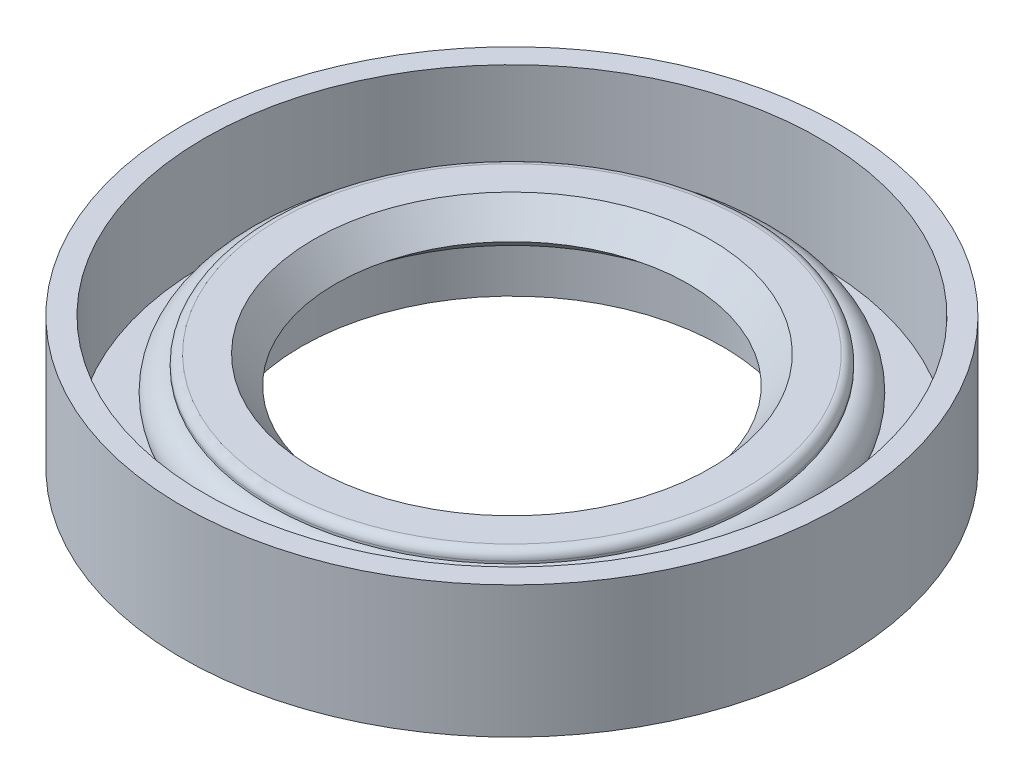
ISO-10303-21;
HEADER;
FILE_DESCRIPTION(('STEP AP214'),'2;1');
FILE_NAME('part.step','',(''),(''),'','','');
FILE_SCHEMA(('AUTOMOTIVE_DESIGN { 1 0 10303 214 1 1 1 1 }'));
ENDSEC;
DATA;
#1=APPLICATION_CONTEXT('core data for automotive mechanical design processes');
#2=APPLICATION_PROTOCOL_DEFINITION('international standard','automotive_design',2000,#1);
#3=PRODUCT_CONTEXT('',#1,'mechanical');
#4=PRODUCT('Part','Part','',(#3));
#5=PRODUCT_RELATED_PRODUCT_CATEGORY('part','',(#4));
#6=PRODUCT_DEFINITION_FORMATION('','',#4);
#7=PRODUCT_DEFINITION_CONTEXT('part definition',#1,'design');
#8=PRODUCT_DEFINITION('design','',#6,#7);
#9=PRODUCT_DEFINITION_SHAPE('','',#8);
#10=(LENGTH_UNIT() NAMED_UNIT(*) SI_UNIT(.MILLI.,.METRE.));
#11=(NAMED_UNIT(*) PLANE_ANGLE_UNIT() SI_UNIT($,.RADIAN.));
#12=(NAMED_UNIT(*) SI_UNIT($,.STERADIAN.) SOLID_ANGLE_UNIT());
#13=UNCERTAINTY_MEASURE_WITH_UNIT(LENGTH_MEASURE(1.E-05),#10,'distance_accuracy_value','');
#14=(GEOMETRIC_REPRESENTATION_CONTEXT(3) GLOBAL_UNCERTAINTY_ASSIGNED_CONTEXT((#13)) GLOBAL_UNIT_ASSIGNED_CONTEXT((#10,
#11,#12)) REPRESENTATION_CONTEXT('',''));
#15=CARTESIAN_POINT('',(0.,0.,0.));
#16=DIRECTION('',(0.,0.,1.));
#17=DIRECTION('',(1.,0.,0.));
#18=AXIS2_PLACEMENT_3D('',#15,#16,#17);
#19=CARTESIAN_POINT('',(0.,-0.314285714285721,0.));
#20=DIRECTION('',(0.,1.,0.));
#21=DIRECTION('',(-1.,0.,0.));
#22=AXIS2_PLACEMENT_3D('',#19,#20,#21);
#23=TOROIDAL_SURFACE('',#22,10.6,0.400000000000001);
#24=CARTESIAN_POINT('',(0.,0.0857142857142792,0.));
#25=DIRECTION('',(0.,1.,0.));
#26=DIRECTION('',(-1.,0.,0.));
#27=AXIS2_PLACEMENT_3D('',#24,#25,#26);
#28=CIRCLE('',#27,10.6);
#29=CARTESIAN_POINT('',(-10.6,0.0857142857142779,0.));
#30=VERTEX_POINT('',#29);
#31=EDGE_CURVE('E10',#30,#30,#28,.T.);
#32=ORIENTED_EDGE('',*,*,#31,.F.);
#33=EDGE_LOOP('',(#32));
#34=FACE_BOUND('',#33,.T.);
#35=CARTESIAN_POINT('',(0.,-0.314285714285722,0.));
#36=DIRECTION('',(0.,1.,0.));
#37=DIRECTION('',(-1.,0.,0.));
#38=AXIS2_PLACEMENT_3D('',#35,#36,#37);
#39=CIRCLE('',#38,11.);
#40=CARTESIAN_POINT('',(-11.,-0.314285714285723,0.));
#41=VERTEX_POINT('',#40);
#42=EDGE_CURVE('E78',#41,#41,#39,.T.);
#43=ORIENTED_EDGE('',*,*,#42,.T.);
#44=EDGE_LOOP('',(#43));
#45=FACE_BOUND('',#44,.T.);
#46=ADVANCED_FACE('F35',(#34,#45),#23,.T.);
#47=CARTESIAN_POINT('',(10.6,0.0857142857142806,0.));
#48=DIRECTION('',(0.,-1.,0.));
#49=DIRECTION('',(1.,0.,0.));
#50=AXIS2_PLACEMENT_3D('',#47,#48,#49);
#51=PLANE('',#50);
#52=CARTESIAN_POINT('',(0.,0.0857142857142775,0.));
#53=DIRECTION('',(0.,1.,0.));
#54=DIRECTION('',(-1.,0.,0.));
#55=AXIS2_PLACEMENT_3D('',#52,#53,#54);
#56=CIRCLE('',#55,9.02446478611469);
#57=CARTESIAN_POINT('',(-9.02446478611469,0.0857142857142764,0.));
#58=VERTEX_POINT('',#57);
#59=EDGE_CURVE('E41',#58,#58,#56,.T.);
#60=ORIENTED_EDGE('',*,*,#59,.F.);
#61=EDGE_LOOP('',(#60));
#62=FACE_BOUND('',#61,.T.);
#63=ORIENTED_EDGE('',*,*,#31,.T.);
#64=EDGE_LOOP('',(#63));
#65=FACE_BOUND('',#64,.T.);
#66=ADVANCED_FACE('F145',(#62,#65),#51,.F.);
#67=CARTESIAN_POINT('',(0.,0.0857142857142775,0.));
#68=DIRECTION('',(0.,1.,0.));
#69=DIRECTION('',(-1.,0.,0.));
#70=AXIS2_PLACEMENT_3D('',#67,#68,#69);
#71=CONICAL_SURFACE('',#70,9.02446478611469,0.674740942223554);
#72=CARTESIAN_POINT('',(0.,-1.16428571428572,0.));
#73=DIRECTION('',(0.,1.,0.));
#74=DIRECTION('',(-1.,0.,0.));
#75=AXIS2_PLACEMENT_3D('',#72,#73,#74);
#76=CIRCLE('',#75,8.02446478611469);
#77=CARTESIAN_POINT('',(-8.02446478611469,-1.16428571428572,0.));
#78=VERTEX_POINT('',#77);
#79=EDGE_CURVE('E45',#78,#78,#76,.T.);
#80=ORIENTED_EDGE('',*,*,#79,.F.);
#81=EDGE_LOOP('',(#80));
#82=FACE_BOUND('',#81,.T.);
#83=ORIENTED_EDGE('',*,*,#59,.T.);
#84=EDGE_LOOP('',(#83));
#85=FACE_BOUND('',#84,.T.);
#86=ADVANCED_FACE('F140',(#82,#85),#71,.F.);
#87=CARTESIAN_POINT('',(0.,-1.16428571428572,0.));
#88=DIRECTION('',(0.,-1.,0.));
#89=DIRECTION('',(1.,0.,0.));
#90=AXIS2_PLACEMENT_3D('',#87,#88,#89);
#91=CONICAL_SURFACE('',#90,8.02446478611469,0.895664793857866);
#92=CARTESIAN_POINT('',(0.,-2.41428571428572,0.));
#93=DIRECTION('',(0.,1.,0.));
#94=DIRECTION('',(-1.,0.,0.));
#95=AXIS2_PLACEMENT_3D('',#92,#93,#94);
#96=CIRCLE('',#95,9.58571428571429);
#97=CARTESIAN_POINT('',(-9.58571428571429,-2.41428571428572,0.));
#98=VERTEX_POINT('',#97);
#99=EDGE_CURVE('E49',#98,#98,#96,.T.);
#100=ORIENTED_EDGE('',*,*,#99,.F.);
#101=EDGE_LOOP('',(#100));
#102=FACE_BOUND('',#101,.T.);
#103=ORIENTED_EDGE('',*,*,#79,.T.);
#104=EDGE_LOOP('',(#103));
#105=FACE_BOUND('',#104,.T.);
#106=ADVANCED_FACE('F134',(#102,#105),#91,.F.);
#107=CARTESIAN_POINT('',(0.,14.8285714285714,0.));
#108=DIRECTION('',(0.,1.,0.));
#109=DIRECTION('',(-1.,0.,0.));
#110=AXIS2_PLACEMENT_3D('',#107,#108,#109);
#111=CYLINDRICAL_SURFACE('',#110,9.58571428571429);
#112=CARTESIAN_POINT('',(0.,-4.41428571428572,0.));
#113=DIRECTION('',(0.,1.,0.));
#114=DIRECTION('',(-1.,0.,0.));
#115=AXIS2_PLACEMENT_3D('',#112,#113,#114);
#116=CIRCLE('',#115,9.58571428571429);
#117=CARTESIAN_POINT('',(-9.58571428571429,-4.41428571428572,0.));
#118=VERTEX_POINT('',#117);
#119=EDGE_CURVE('E54',#118,#118,#116,.T.);
#120=ORIENTED_EDGE('',*,*,#119,.F.);
#121=EDGE_LOOP('',(#120));
#122=FACE_BOUND('',#121,.T.);
#123=ORIENTED_EDGE('',*,*,#99,.T.);
#124=EDGE_LOOP('',(#123));
#125=FACE_BOUND('',#124,.T.);
#126=ADVANCED_FACE('F128',(#122,#125),#111,.F.);
#127=CARTESIAN_POINT('',(9.58571428571429,-4.41428571428572,0.));
#128=DIRECTION('',(0.,1.,0.));
#129=DIRECTION('',(-1.,0.,0.));
#130=AXIS2_PLACEMENT_3D('',#127,#128,#129);
#131=PLANE('',#130);
#132=CARTESIAN_POINT('',(0.,-4.41428571428572,0.));
#133=DIRECTION('',(0.,1.,0.));
#134=DIRECTION('',(-1.,0.,0.));
#135=AXIS2_PLACEMENT_3D('',#132,#133,#134);
#136=CIRCLE('',#135,15.);
#137=CARTESIAN_POINT('',(-15.,-4.41428571428572,0.));
#138=VERTEX_POINT('',#137);
#139=EDGE_CURVE('E57',#138,#138,#136,.T.);
#140=ORIENTED_EDGE('',*,*,#139,.F.);
#141=EDGE_LOOP('',(#140));
#142=FACE_BOUND('',#141,.T.);
#143=ORIENTED_EDGE('',*,*,#119,.T.);
#144=EDGE_LOOP('',(#143));
#145=FACE_BOUND('',#144,.T.);
#146=ADVANCED_FACE('F122',(#142,#145),#131,.F.);
#147=CARTESIAN_POINT('',(0.,14.8285714285714,0.));
#148=DIRECTION('',(0.,1.,0.));
#149=DIRECTION('',(-1.,0.,0.));
#150=AXIS2_PLACEMENT_3D('',#147,#148,#149);
#151=CYLINDRICAL_SURFACE('',#150,15.);
#152=CARTESIAN_POINT('',(0.,1.58571428571428,0.));
#153=DIRECTION('',(0.,1.,0.));
#154=DIRECTION('',(-1.,0.,0.));
#155=AXIS2_PLACEMENT_3D('',#152,#153,#154);
#156=CIRCLE('',#155,15.);
#157=CARTESIAN_POINT('',(-15.,1.58571428571428,0.));
#158=VERTEX_POINT('',#157);
#159=EDGE_CURVE('E60',#158,#158,#156,.T.);
#160=ORIENTED_EDGE('',*,*,#159,.F.);
#161=EDGE_LOOP('',(#160));
#162=FACE_BOUND('',#161,.T.);
#163=ORIENTED_EDGE('',*,*,#139,.T.);
#164=EDGE_LOOP('',(#163));
#165=FACE_BOUND('',#164,.T.);
#166=ADVANCED_FACE('F116',(#162,#165),#151,.T.);
#167=CARTESIAN_POINT('',(15.,1.58571428571428,0.));
#168=DIRECTION('',(0.,-1.,0.));
#169=DIRECTION('',(1.,0.,0.));
#170=AXIS2_PLACEMENT_3D('',#167,#168,#169);
#171=PLANE('',#170);
#172=CARTESIAN_POINT('',(0.,1.58571428571428,0.));
#173=DIRECTION('',(0.,1.,0.));
#174=DIRECTION('',(-1.,0.,0.));
#175=AXIS2_PLACEMENT_3D('',#172,#173,#174);
#176=CIRCLE('',#175,14.);
#177=CARTESIAN_POINT('',(-14.,1.58571428571428,0.));
#178=VERTEX_POINT('',#177);
#179=EDGE_CURVE('E63',#178,#178,#176,.T.);
#180=ORIENTED_EDGE('',*,*,#179,.F.);
#181=EDGE_LOOP('',(#180));
#182=FACE_BOUND('',#181,.T.);
#183=ORIENTED_EDGE('',*,*,#159,.T.);
#184=EDGE_LOOP('',(#183));
#185=FACE_BOUND('',#184,.T.);
#186=ADVANCED_FACE('F110',(#182,#185),#171,.F.);
#187=CARTESIAN_POINT('',(0.,14.8285714285714,0.));
#188=DIRECTION('',(0.,1.,0.));
#189=DIRECTION('',(-1.,0.,0.));
#190=AXIS2_PLACEMENT_3D('',#187,#188,#189);
#191=CYLINDRICAL_SURFACE('',#190,14.);
#192=CARTESIAN_POINT('',(0.,-3.41428571428572,0.));
#193=DIRECTION('',(0.,1.,0.));
#194=DIRECTION('',(-1.,0.,0.));
#195=AXIS2_PLACEMENT_3D('',#192,#193,#194);
#196=CIRCLE('',#195,14.);
#197=CARTESIAN_POINT('',(-14.,-3.41428571428572,0.));
#198=VERTEX_POINT('',#197);
#199=EDGE_CURVE('E66',#198,#198,#196,.T.);
#200=ORIENTED_EDGE('',*,*,#199,.F.);
#201=EDGE_LOOP('',(#200));
#202=FACE_BOUND('',#201,.T.);
#203=ORIENTED_EDGE('',*,*,#179,.T.);
#204=EDGE_LOOP('',(#203));
#205=FACE_BOUND('',#204,.T.);
#206=ADVANCED_FACE('F104',(#202,#205),#191,.F.);
#207=CARTESIAN_POINT('',(14.,-3.41428571428572,0.));
#208=DIRECTION('',(0.,-1.,0.));
#209=DIRECTION('',(1.,0.,0.));
#210=AXIS2_PLACEMENT_3D('',#207,#208,#209);
#211=PLANE('',#210);
#212=CARTESIAN_POINT('',(0.,-3.41428571428572,0.));
#213=DIRECTION('',(0.,1.,0.));
#214=DIRECTION('',(-1.,0.,0.));
#215=AXIS2_PLACEMENT_3D('',#212,#213,#214);
#216=CIRCLE('',#215,11.);
#217=CARTESIAN_POINT('',(-11.,-3.41428571428572,0.));
#218=VERTEX_POINT('',#217);
#219=EDGE_CURVE('E69',#218,#218,#216,.T.);
#220=ORIENTED_EDGE('',*,*,#219,.F.);
#221=EDGE_LOOP('',(#220));
#222=FACE_BOUND('',#221,.T.);
#223=ORIENTED_EDGE('',*,*,#199,.T.);
#224=EDGE_LOOP('',(#223));
#225=FACE_BOUND('',#224,.T.);
#226=ADVANCED_FACE('F98',(#222,#225),#211,.F.);
#227=CARTESIAN_POINT('',(0.,14.8285714285714,0.));
#228=DIRECTION('',(0.,1.,0.));
#229=DIRECTION('',(-1.,0.,0.));
#230=AXIS2_PLACEMENT_3D('',#227,#228,#229);
#231=CYLINDRICAL_SURFACE('',#230,11.);
#232=CARTESIAN_POINT('',(0.,-2.41428571428572,0.));
#233=DIRECTION('',(0.,1.,0.));
#234=DIRECTION('',(-1.,0.,0.));
#235=AXIS2_PLACEMENT_3D('',#232,#233,#234);
#236=CIRCLE('',#235,11.);
#237=CARTESIAN_POINT('',(-11.,-2.41428571428572,0.));
#238=VERTEX_POINT('',#237);
#239=EDGE_CURVE('E72',#238,#238,#236,.T.);
#240=ORIENTED_EDGE('',*,*,#239,.F.);
#241=EDGE_LOOP('',(#240));
#242=FACE_BOUND('',#241,.T.);
#243=ORIENTED_EDGE('',*,*,#219,.T.);
#244=EDGE_LOOP('',(#243));
#245=FACE_BOUND('',#244,.T.);
#246=ADVANCED_FACE('F92',(#242,#245),#231,.T.);
#247=CARTESIAN_POINT('',(0.,-1.41428571428572,0.));
#248=DIRECTION('',(0.,1.,0.));
#249=DIRECTION('',(-1.,0.,0.));
#250=AXIS2_PLACEMENT_3D('',#247,#248,#249);
#251=TOROIDAL_SURFACE('',#250,11.,1.);
#252=CARTESIAN_POINT('',(0.,-0.414285714285721,0.));
#253=DIRECTION('',(0.,1.,0.));
#254=DIRECTION('',(-1.,0.,0.));
#255=AXIS2_PLACEMENT_3D('',#252,#253,#254);
#256=CIRCLE('',#255,11.);
#257=CARTESIAN_POINT('',(-11.,-0.414285714285723,0.));
#258=VERTEX_POINT('',#257);
#259=EDGE_CURVE('E75',#258,#258,#256,.T.);
#260=ORIENTED_EDGE('',*,*,#259,.F.);
#261=EDGE_LOOP('',(#260));
#262=FACE_BOUND('',#261,.T.);
#263=ORIENTED_EDGE('',*,*,#239,.T.);
#264=EDGE_LOOP('',(#263));
#265=FACE_BOUND('',#264,.T.);
#266=ADVANCED_FACE('F86',(#262,#265),#251,.T.);
#267=CARTESIAN_POINT('',(0.,14.8285714285714,0.));
#268=DIRECTION('',(0.,1.,0.));
#269=DIRECTION('',(-1.,0.,0.));
#270=AXIS2_PLACEMENT_3D('',#267,#268,#269);
#271=CYLINDRICAL_SURFACE('',#270,11.);
#272=ORIENTED_EDGE('',*,*,#42,.F.);
#273=EDGE_LOOP('',(#272));
#274=FACE_BOUND('',#273,.T.);
#275=ORIENTED_EDGE('',*,*,#259,.T.);
#276=EDGE_LOOP('',(#275));
#277=FACE_BOUND('',#276,.T.);
#278=ADVANCED_FACE('F83',(#274,#277),#271,.T.);
#279=CLOSED_SHELL('',(#46,#66,#86,#106,#126,#146,#166,#186,#206,#226,#246,#266,#278));
#280=MANIFOLD_SOLID_BREP('B2',#279);
#281=ADVANCED_BREP_SHAPE_REPRESENTATION('',(#18,#280),#14);
#282=SHAPE_DEFINITION_REPRESENTATION(#9,#281);
ENDSEC;
END-ISO-10303-21;
